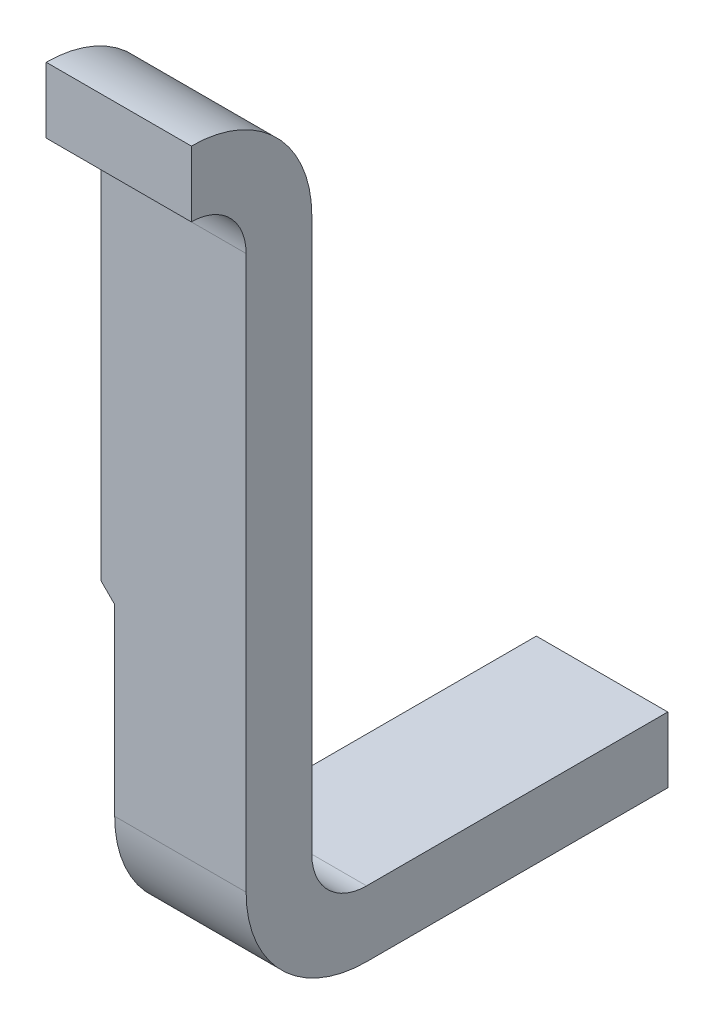
ISO-10303-21;
HEADER;
FILE_DESCRIPTION(('STEP AP214'),'2;1');
FILE_NAME('part.step','',(''),(''),'','','');
FILE_SCHEMA(('AUTOMOTIVE_DESIGN { 1 0 10303 214 1 1 1 1 }'));
ENDSEC;
DATA;
#1=APPLICATION_CONTEXT('core data for automotive mechanical design processes');
#2=APPLICATION_PROTOCOL_DEFINITION('international standard','automotive_design',2000,#1);
#3=PRODUCT_CONTEXT('',#1,'mechanical');
#4=PRODUCT('Part','Part','',(#3));
#5=PRODUCT_RELATED_PRODUCT_CATEGORY('part','',(#4));
#6=PRODUCT_DEFINITION_FORMATION('','',#4);
#7=PRODUCT_DEFINITION_CONTEXT('part definition',#1,'design');
#8=PRODUCT_DEFINITION('design','',#6,#7);
#9=PRODUCT_DEFINITION_SHAPE('','',#8);
#10=(LENGTH_UNIT() NAMED_UNIT(*) SI_UNIT(.MILLI.,.METRE.));
#11=(NAMED_UNIT(*) PLANE_ANGLE_UNIT() SI_UNIT($,.RADIAN.));
#12=(NAMED_UNIT(*) SI_UNIT($,.STERADIAN.) SOLID_ANGLE_UNIT());
#13=UNCERTAINTY_MEASURE_WITH_UNIT(LENGTH_MEASURE(1.E-05),#10,'distance_accuracy_value','');
#14=(GEOMETRIC_REPRESENTATION_CONTEXT(3) GLOBAL_UNCERTAINTY_ASSIGNED_CONTEXT((#13)) GLOBAL_UNIT_ASSIGNED_CONTEXT((#10,
#11,#12)) REPRESENTATION_CONTEXT('',''));
#15=CARTESIAN_POINT('',(0.,0.,0.));
#16=DIRECTION('',(0.,0.,1.));
#17=DIRECTION('',(1.,0.,0.));
#18=AXIS2_PLACEMENT_3D('',#15,#16,#17);
#19=CARTESIAN_POINT('',(17.46210819787,11.48941215274,-11.17169883308));
#20=DIRECTION('',(0.,0.,-1.));
#21=DIRECTION('',(-1.,0.,0.));
#22=AXIS2_PLACEMENT_3D('',#19,#20,#21);
#23=PLANE('',#22);
#24=DIRECTION('',(0.,1.,0.));
#25=VECTOR('',#24,1.);
#26=CARTESIAN_POINT('',(18.42710814532,5.079903349409,-11.17169883308));
#27=LINE('',#26,#25);
#28=CARTESIAN_POINT('',(18.42710814532,12.81951558355,-11.17169883308));
#29=VERTEX_POINT('',#28);
#30=CARTESIAN_POINT('',(18.42710814532,12.93951558355,-11.17169883308));
#31=VERTEX_POINT('',#30);
#32=EDGE_CURVE('E11',#29,#31,#27,.T.);
#33=ORIENTED_EDGE('',*,*,#32,.T.);
#34=DIRECTION('',(-1.,0.,0.));
#35=VECTOR('',#34,1.);
#36=CARTESIAN_POINT('',(13.11210817501,12.93951558355,-11.17169883308));
#37=LINE('',#36,#35);
#38=CARTESIAN_POINT('',(18.16210814532,12.93951558355,-11.17169883308));
#39=VERTEX_POINT('',#38);
#40=EDGE_CURVE('E199',#31,#39,#37,.T.);
#41=ORIENTED_EDGE('',*,*,#40,.T.);
#42=DIRECTION('',(0.,-1.,0.));
#43=VECTOR('',#42,1.);
#44=CARTESIAN_POINT('',(18.16210814532,5.079903349409,-11.17169883308));
#45=LINE('',#44,#43);
#46=CARTESIAN_POINT('',(18.16210814532,12.81951558355,-11.17169883308));
#47=VERTEX_POINT('',#46);
#48=EDGE_CURVE('E197',#39,#47,#45,.T.);
#49=ORIENTED_EDGE('',*,*,#48,.T.);
#50=DIRECTION('',(1.,0.,0.));
#51=VECTOR('',#50,1.);
#52=CARTESIAN_POINT('',(0.,12.81951558355,-11.17169883308));
#53=LINE('',#52,#51);
#54=EDGE_CURVE('E218',#47,#29,#53,.T.);
#55=ORIENTED_EDGE('',*,*,#54,.T.);
#56=EDGE_LOOP('',(#33,#41,#49,#55));
#57=FACE_BOUND('',#56,.T.);
#58=ADVANCED_FACE('F17',(#57),#23,.F.);
#59=CARTESIAN_POINT('',(18.42710814532,12.71951558355,-11.17169883308));
#60=DIRECTION('',(1.,0.,0.));
#61=DIRECTION('',(0.,0.,-1.));
#62=AXIS2_PLACEMENT_3D('',#59,#60,#61);
#63=PLANE('',#62);
#64=CARTESIAN_POINT('',(18.42710814532,12.71951558355,-11.17169883308));
#65=DIRECTION('',(-1.,0.,0.));
#66=DIRECTION('',(0.,0.,1.));
#67=AXIS2_PLACEMENT_3D('',#64,#65,#66);
#68=CIRCLE('',#67,0.22);
#69=CARTESIAN_POINT('',(18.42710814532,12.71951558355,-11.39169883308));
#70=VERTEX_POINT('',#69);
#71=EDGE_CURVE('E28',#31,#70,#68,.T.);
#72=ORIENTED_EDGE('',*,*,#71,.F.);
#73=ORIENTED_EDGE('',*,*,#32,.F.);
#74=CARTESIAN_POINT('',(18.42710814532,12.71951558355,-11.17169883308));
#75=DIRECTION('',(-1.,0.,0.));
#76=DIRECTION('',(0.,0.,-1.));
#77=AXIS2_PLACEMENT_3D('',#74,#75,#76);
#78=CIRCLE('',#77,0.1);
#79=CARTESIAN_POINT('',(18.42710814532,12.71951558355,-11.27169883308));
#80=VERTEX_POINT('',#79);
#81=EDGE_CURVE('E166',#29,#80,#78,.T.);
#82=ORIENTED_EDGE('',*,*,#81,.T.);
#83=DIRECTION('',(0.,-1.,0.));
#84=VECTOR('',#83,1.);
#85=CARTESIAN_POINT('',(18.42710814532,12.71951558355,-11.27169883308));
#86=LINE('',#85,#84);
#87=CARTESIAN_POINT('',(18.42710814532,11.70951558355,-11.27169883308));
#88=VERTEX_POINT('',#87);
#89=EDGE_CURVE('E175',#80,#88,#86,.T.);
#90=ORIENTED_EDGE('',*,*,#89,.T.);
#91=CARTESIAN_POINT('',(18.42710814532,11.70951558355,-11.49169883308));
#92=DIRECTION('',(1.,0.,0.));
#93=DIRECTION('',(0.,0.,-1.));
#94=AXIS2_PLACEMENT_3D('',#91,#92,#93);
#95=CIRCLE('',#94,0.22);
#96=CARTESIAN_POINT('',(18.42710814532,11.48951558355,-11.49169883308));
#97=VERTEX_POINT('',#96);
#98=EDGE_CURVE('E234',#88,#97,#95,.T.);
#99=ORIENTED_EDGE('',*,*,#98,.T.);
#100=DIRECTION('',(0.,0.,-1.));
#101=VECTOR('',#100,1.);
#102=CARTESIAN_POINT('',(18.42710814532,11.48951558355,-11.17169883308));
#103=LINE('',#102,#101);
#104=CARTESIAN_POINT('',(18.42710814532,11.48951558355,-12.04169883308));
#105=VERTEX_POINT('',#104);
#106=EDGE_CURVE('E155',#97,#105,#103,.T.);
#107=ORIENTED_EDGE('',*,*,#106,.T.);
#108=DIRECTION('',(0.,1.,0.));
#109=VECTOR('',#108,1.);
#110=CARTESIAN_POINT('',(18.42710814532,12.71951558355,-12.04169883308));
#111=LINE('',#110,#109);
#112=CARTESIAN_POINT('',(18.42710814532,11.60951558355,-12.04169883308));
#113=VERTEX_POINT('',#112);
#114=EDGE_CURVE('E159',#105,#113,#111,.T.);
#115=ORIENTED_EDGE('',*,*,#114,.T.);
#116=DIRECTION('',(0.,0.,1.));
#117=VECTOR('',#116,1.);
#118=CARTESIAN_POINT('',(18.42710814532,11.60951558355,-11.17169883308));
#119=LINE('',#118,#117);
#120=CARTESIAN_POINT('',(18.42710814532,11.60951558355,-11.49169883308));
#121=VERTEX_POINT('',#120);
#122=EDGE_CURVE('E124',#113,#121,#119,.T.);
#123=ORIENTED_EDGE('',*,*,#122,.T.);
#124=CARTESIAN_POINT('',(18.42710814532,11.70951558355,-11.49169883308));
#125=DIRECTION('',(-1.,0.,0.));
#126=DIRECTION('',(0.,0.,1.));
#127=AXIS2_PLACEMENT_3D('',#124,#125,#126);
#128=CIRCLE('',#127,0.1);
#129=CARTESIAN_POINT('',(18.42710814532,11.70951558355,-11.39169883308));
#130=VERTEX_POINT('',#129);
#131=EDGE_CURVE('E185',#121,#130,#128,.T.);
#132=ORIENTED_EDGE('',*,*,#131,.T.);
#133=DIRECTION('',(0.,1.,0.));
#134=VECTOR('',#133,1.);
#135=CARTESIAN_POINT('',(18.42710814532,12.71951558355,-11.39169883308));
#136=LINE('',#135,#134);
#137=EDGE_CURVE('E176',#130,#70,#136,.T.);
#138=ORIENTED_EDGE('',*,*,#137,.T.);
#139=EDGE_LOOP('',(#72,#73,#82,#90,#99,#107,#115,#123,#132,#138));
#140=FACE_BOUND('',#139,.T.);
#141=ADVANCED_FACE('F19',(#140),#63,.T.);
#142=CARTESIAN_POINT('',(12.81210814532,12.71951558355,-11.17169883308));
#143=DIRECTION('',(1.,0.,0.));
#144=DIRECTION('',(0.,0.,1.));
#145=AXIS2_PLACEMENT_3D('',#142,#143,#144);
#146=CYLINDRICAL_SURFACE('',#145,0.22);
#147=ORIENTED_EDGE('',*,*,#40,.F.);
#148=ORIENTED_EDGE('',*,*,#71,.T.);
#149=DIRECTION('',(-1.,0.,0.));
#150=VECTOR('',#149,1.);
#151=CARTESIAN_POINT('',(12.81210814532,12.71951558355,-11.39169883308));
#152=LINE('',#151,#150);
#153=CARTESIAN_POINT('',(18.16210814532,12.71951558355,-11.39169883308));
#154=VERTEX_POINT('',#153);
#155=EDGE_CURVE('E208',#70,#154,#152,.T.);
#156=ORIENTED_EDGE('',*,*,#155,.T.);
#157=CARTESIAN_POINT('',(18.16210814532,12.71951558355,-11.17169883308));
#158=DIRECTION('',(1.,0.,0.));
#159=DIRECTION('',(0.,0.,1.));
#160=AXIS2_PLACEMENT_3D('',#157,#158,#159);
#161=CIRCLE('',#160,0.22);
#162=EDGE_CURVE('E169',#154,#39,#161,.T.);
#163=ORIENTED_EDGE('',*,*,#162,.T.);
#164=EDGE_LOOP('',(#147,#148,#156,#163));
#165=FACE_BOUND('',#164,.T.);
#166=ADVANCED_FACE('F304',(#165),#146,.T.);
#167=CARTESIAN_POINT('',(18.16210814532,11.48951558355,-11.91169883308));
#168=DIRECTION('',(1.,0.,0.));
#169=DIRECTION('',(0.,0.,-1.));
#170=AXIS2_PLACEMENT_3D('',#167,#168,#169);
#171=PLANE('',#170);
#172=ORIENTED_EDGE('',*,*,#162,.F.);
#173=DIRECTION('',(0.,1.,0.));
#174=VECTOR('',#173,1.);
#175=CARTESIAN_POINT('',(18.16210814532,11.48951558355,-11.39169883308));
#176=LINE('',#175,#174);
#177=CARTESIAN_POINT('',(18.16210814532,12.06951558355,-11.39169883308));
#178=VERTEX_POINT('',#177);
#179=EDGE_CURVE('E196',#178,#154,#176,.T.);
#180=ORIENTED_EDGE('',*,*,#179,.F.);
#181=DIRECTION('',(0.,0.,-1.));
#182=VECTOR('',#181,1.);
#183=CARTESIAN_POINT('',(18.16210814532,12.06951558355,-11.91169883308));
#184=LINE('',#183,#182);
#185=CARTESIAN_POINT('',(18.16210814532,12.06951558355,-11.27169883308));
#186=VERTEX_POINT('',#185);
#187=EDGE_CURVE('E180',#186,#178,#184,.T.);
#188=ORIENTED_EDGE('',*,*,#187,.F.);
#189=DIRECTION('',(0.,-1.,0.));
#190=VECTOR('',#189,1.);
#191=CARTESIAN_POINT('',(18.16210814532,11.48951558355,-11.27169883308));
#192=LINE('',#191,#190);
#193=CARTESIAN_POINT('',(18.16210814532,12.71951558355,-11.27169883308));
#194=VERTEX_POINT('',#193);
#195=EDGE_CURVE('E172',#194,#186,#192,.T.);
#196=ORIENTED_EDGE('',*,*,#195,.F.);
#197=CARTESIAN_POINT('',(18.16210814532,12.71951558355,-11.17169883308));
#198=DIRECTION('',(-1.,0.,0.));
#199=DIRECTION('',(0.,0.,-1.));
#200=AXIS2_PLACEMENT_3D('',#197,#198,#199);
#201=CIRCLE('',#200,0.1);
#202=EDGE_CURVE('E170',#47,#194,#201,.T.);
#203=ORIENTED_EDGE('',*,*,#202,.F.);
#204=ORIENTED_EDGE('',*,*,#48,.F.);
#205=EDGE_LOOP('',(#172,#180,#188,#196,#203,#204));
#206=FACE_BOUND('',#205,.T.);
#207=ADVANCED_FACE('F301',(#206),#171,.F.);
#208=CARTESIAN_POINT('',(19.01210814532,12.71951558355,-11.17169883308));
#209=DIRECTION('',(-1.,0.,0.));
#210=DIRECTION('',(0.,0.,-1.));
#211=AXIS2_PLACEMENT_3D('',#208,#209,#210);
#212=CYLINDRICAL_SURFACE('',#211,0.1);
#213=ORIENTED_EDGE('',*,*,#54,.F.);
#214=ORIENTED_EDGE('',*,*,#202,.T.);
#215=DIRECTION('',(-1.,0.,0.));
#216=VECTOR('',#215,1.);
#217=CARTESIAN_POINT('',(19.01210814532,12.71951558355,-11.27169883308));
#218=LINE('',#217,#216);
#219=EDGE_CURVE('E221',#80,#194,#218,.T.);
#220=ORIENTED_EDGE('',*,*,#219,.F.);
#221=ORIENTED_EDGE('',*,*,#81,.F.);
#222=EDGE_LOOP('',(#213,#214,#220,#221));
#223=FACE_BOUND('',#222,.T.);
#224=ADVANCED_FACE('F366',(#223),#212,.F.);
#225=CARTESIAN_POINT('',(18.11210814532,11.48951558355,-11.27169883308));
#226=DIRECTION('',(0.,0.,1.));
#227=DIRECTION('',(1.,0.,0.));
#228=AXIS2_PLACEMENT_3D('',#225,#226,#227);
#229=PLANE('',#228);
#230=ORIENTED_EDGE('',*,*,#195,.T.);
#231=DIRECTION('',(0.707106781186048,-0.707106781187048,0.));
#232=VECTOR('',#231,1.);
#233=CARTESIAN_POINT('',(18.16210814532,12.06951558355,-11.27169883308));
#234=LINE('',#233,#232);
#235=CARTESIAN_POINT('',(18.18710814532,12.04451558355,-11.27169883308));
#236=VERTEX_POINT('',#235);
#237=EDGE_CURVE('E177',#186,#236,#234,.T.);
#238=ORIENTED_EDGE('',*,*,#237,.T.);
#239=DIRECTION('',(0.,-1.,0.));
#240=VECTOR('',#239,1.);
#241=CARTESIAN_POINT('',(18.18710814532,11.48951558355,-11.27169883308));
#242=LINE('',#241,#240);
#243=CARTESIAN_POINT('',(18.18710814532,11.70951558355,-11.27169883308));
#244=VERTEX_POINT('',#243);
#245=EDGE_CURVE('E164',#236,#244,#242,.T.);
#246=ORIENTED_EDGE('',*,*,#245,.T.);
#247=DIRECTION('',(1.,0.,0.));
#248=VECTOR('',#247,1.);
#249=CARTESIAN_POINT('',(18.11210814532,11.70951558355,-11.27169883308));
#250=LINE('',#249,#248);
#251=EDGE_CURVE('E153',#244,#88,#250,.T.);
#252=ORIENTED_EDGE('',*,*,#251,.T.);
#253=ORIENTED_EDGE('',*,*,#89,.F.);
#254=ORIENTED_EDGE('',*,*,#219,.T.);
#255=EDGE_LOOP('',(#230,#238,#246,#252,#253,#254));
#256=FACE_BOUND('',#255,.T.);
#257=ADVANCED_FACE('F260',(#256),#229,.T.);
#258=CARTESIAN_POINT('',(12.81210814532,12.93951558355,-11.39169883308));
#259=DIRECTION('',(0.,0.,1.));
#260=DIRECTION('',(1.,0.,0.));
#261=AXIS2_PLACEMENT_3D('',#258,#259,#260);
#262=PLANE('',#261);
#263=DIRECTION('',(0.,-1.,0.));
#264=VECTOR('',#263,1.);
#265=CARTESIAN_POINT('',(18.18710814532,12.93951558355,-11.39169883308));
#266=LINE('',#265,#264);
#267=CARTESIAN_POINT('',(18.18710814532,12.04451558355,-11.39169883308));
#268=VERTEX_POINT('',#267);
#269=CARTESIAN_POINT('',(18.18710814532,11.70951558355,-11.39169883308));
#270=VERTEX_POINT('',#269);
#271=EDGE_CURVE('E149',#268,#270,#266,.T.);
#272=ORIENTED_EDGE('',*,*,#271,.F.);
#273=DIRECTION('',(0.707106781186048,-0.707106781187048,0.));
#274=VECTOR('',#273,1.);
#275=CARTESIAN_POINT('',(18.16210814532,12.06951558355,-11.39169883308));
#276=LINE('',#275,#274);
#277=EDGE_CURVE('E181',#178,#268,#276,.T.);
#278=ORIENTED_EDGE('',*,*,#277,.F.);
#279=ORIENTED_EDGE('',*,*,#179,.T.);
#280=ORIENTED_EDGE('',*,*,#155,.F.);
#281=ORIENTED_EDGE('',*,*,#137,.F.);
#282=DIRECTION('',(1.,0.,0.));
#283=VECTOR('',#282,1.);
#284=CARTESIAN_POINT('',(12.81210814532,11.70951558355,-11.39169883308));
#285=LINE('',#284,#283);
#286=EDGE_CURVE('E137',#270,#130,#285,.T.);
#287=ORIENTED_EDGE('',*,*,#286,.F.);
#288=EDGE_LOOP('',(#272,#278,#279,#280,#281,#287));
#289=FACE_BOUND('',#288,.T.);
#290=ADVANCED_FACE('F286',(#289),#262,.F.);
#291=CARTESIAN_POINT('',(18.16210814532,12.06951558355,-11.91169883308));
#292=DIRECTION('',(0.707106781187048,0.707106781186048,0.));
#293=DIRECTION('',(0.,0.,-1.));
#294=AXIS2_PLACEMENT_3D('',#291,#292,#293);
#295=PLANE('',#294);
#296=ORIENTED_EDGE('',*,*,#277,.T.);
#297=DIRECTION('',(0.,0.,-1.));
#298=VECTOR('',#297,1.);
#299=CARTESIAN_POINT('',(18.18710814532,12.04451558355,-11.91169883308));
#300=LINE('',#299,#298);
#301=EDGE_CURVE('E189',#236,#268,#300,.T.);
#302=ORIENTED_EDGE('',*,*,#301,.F.);
#303=ORIENTED_EDGE('',*,*,#237,.F.);
#304=ORIENTED_EDGE('',*,*,#187,.T.);
#305=EDGE_LOOP('',(#296,#302,#303,#304));
#306=FACE_BOUND('',#305,.T.);
#307=ADVANCED_FACE('F266',(#306),#295,.F.);
#308=CARTESIAN_POINT('',(18.11210814532,11.70951558355,-11.49169883308));
#309=DIRECTION('',(-1.,0.,0.));
#310=DIRECTION('',(0.,0.,-1.));
#311=AXIS2_PLACEMENT_3D('',#308,#309,#310);
#312=CYLINDRICAL_SURFACE('',#311,0.22);
#313=ORIENTED_EDGE('',*,*,#98,.F.);
#314=ORIENTED_EDGE('',*,*,#251,.F.);
#315=CARTESIAN_POINT('',(18.18710814532,11.70951558355,-11.49169883308));
#316=DIRECTION('',(1.,0.,0.));
#317=DIRECTION('',(0.,0.,-1.));
#318=AXIS2_PLACEMENT_3D('',#315,#316,#317);
#319=CIRCLE('',#318,0.22);
#320=CARTESIAN_POINT('',(18.18710814532,11.48951558355,-11.49169883308));
#321=VERTEX_POINT('',#320);
#322=EDGE_CURVE('E160',#244,#321,#319,.T.);
#323=ORIENTED_EDGE('',*,*,#322,.T.);
#324=DIRECTION('',(-1.,0.,0.));
#325=VECTOR('',#324,1.);
#326=CARTESIAN_POINT('',(18.61210814532,11.48951558355,-11.49169883308));
#327=LINE('',#326,#325);
#328=EDGE_CURVE('E158',#97,#321,#327,.T.);
#329=ORIENTED_EDGE('',*,*,#328,.F.);
#330=EDGE_LOOP('',(#313,#314,#323,#329));
#331=FACE_BOUND('',#330,.T.);
#332=ADVANCED_FACE('F255',(#331),#312,.T.);
#333=CARTESIAN_POINT('',(18.61210814532,11.48951558355,-8.041698833076));
#334=DIRECTION('',(0.,-1.,0.));
#335=DIRECTION('',(0.,0.,-1.));
#336=AXIS2_PLACEMENT_3D('',#333,#334,#335);
#337=PLANE('',#336);
#338=DIRECTION('',(0.,0.,-1.));
#339=VECTOR('',#338,1.);
#340=CARTESIAN_POINT('',(18.18710814532,11.48951558355,-8.041698833076));
#341=LINE('',#340,#339);
#342=CARTESIAN_POINT('',(18.18710814532,11.48951558355,-12.04169883308));
#343=VERTEX_POINT('',#342);
#344=EDGE_CURVE('E165',#321,#343,#341,.T.);
#345=ORIENTED_EDGE('',*,*,#344,.T.);
#346=DIRECTION('',(1.,0.,0.));
#347=VECTOR('',#346,1.);
#348=CARTESIAN_POINT('',(12.02567879084,11.48951558355,-12.04169883308));
#349=LINE('',#348,#347);
#350=EDGE_CURVE('E21',#343,#105,#349,.T.);
#351=ORIENTED_EDGE('',*,*,#350,.T.);
#352=ORIENTED_EDGE('',*,*,#106,.F.);
#353=ORIENTED_EDGE('',*,*,#328,.T.);
#354=EDGE_LOOP('',(#345,#351,#352,#353));
#355=FACE_BOUND('',#354,.T.);
#356=ADVANCED_FACE('F248',(#355),#337,.T.);
#357=CARTESIAN_POINT('',(12.02567879084,1.609515583551,-12.04169883308));
#358=DIRECTION('',(0.,0.,1.));
#359=DIRECTION('',(1.,0.,0.));
#360=AXIS2_PLACEMENT_3D('',#357,#358,#359);
#361=PLANE('',#360);
#362=ORIENTED_EDGE('',*,*,#350,.F.);
#363=DIRECTION('',(0.,-1.,0.));
#364=VECTOR('',#363,1.);
#365=CARTESIAN_POINT('',(18.18710814532,1.609515583551,-12.04169883308));
#366=LINE('',#365,#364);
#367=CARTESIAN_POINT('',(18.18710814532,11.60951558355,-12.04169883308));
#368=VERTEX_POINT('',#367);
#369=EDGE_CURVE('E130',#368,#343,#366,.T.);
#370=ORIENTED_EDGE('',*,*,#369,.F.);
#371=DIRECTION('',(1.,0.,0.));
#372=VECTOR('',#371,1.);
#373=CARTESIAN_POINT('',(12.81210814532,11.60951558355,-12.04169883308));
#374=LINE('',#373,#372);
#375=EDGE_CURVE('E116',#368,#113,#374,.T.);
#376=ORIENTED_EDGE('',*,*,#375,.T.);
#377=ORIENTED_EDGE('',*,*,#114,.F.);
#378=EDGE_LOOP('',(#362,#370,#376,#377));
#379=FACE_BOUND('',#378,.T.);
#380=ADVANCED_FACE('F131',(#379),#361,.F.);
#381=CARTESIAN_POINT('',(12.81210814532,11.60951558355,-11.91169883308));
#382=DIRECTION('',(0.,-1.,0.));
#383=DIRECTION('',(0.,0.,-1.));
#384=AXIS2_PLACEMENT_3D('',#381,#382,#383);
#385=PLANE('',#384);
#386=DIRECTION('',(0.,0.,-1.));
#387=VECTOR('',#386,1.);
#388=CARTESIAN_POINT('',(18.18710814532,11.60951558355,-11.91169883308));
#389=LINE('',#388,#387);
#390=CARTESIAN_POINT('',(18.18710814532,11.60951558355,-11.49169883308));
#391=VERTEX_POINT('',#390);
#392=EDGE_CURVE('E121',#391,#368,#389,.T.);
#393=ORIENTED_EDGE('',*,*,#392,.F.);
#394=DIRECTION('',(1.,0.,0.));
#395=VECTOR('',#394,1.);
#396=CARTESIAN_POINT('',(12.81210814532,11.60951558355,-11.49169883308));
#397=LINE('',#396,#395);
#398=EDGE_CURVE('E190',#391,#121,#397,.T.);
#399=ORIENTED_EDGE('',*,*,#398,.T.);
#400=ORIENTED_EDGE('',*,*,#122,.F.);
#401=ORIENTED_EDGE('',*,*,#375,.F.);
#402=EDGE_LOOP('',(#393,#399,#400,#401));
#403=FACE_BOUND('',#402,.T.);
#404=ADVANCED_FACE('F118',(#403),#385,.F.);
#405=CARTESIAN_POINT('',(12.81210814532,11.70951558355,-11.49169883308));
#406=DIRECTION('',(1.,0.,0.));
#407=DIRECTION('',(0.,0.,1.));
#408=AXIS2_PLACEMENT_3D('',#405,#406,#407);
#409=CYLINDRICAL_SURFACE('',#408,0.1);
#410=ORIENTED_EDGE('',*,*,#286,.T.);
#411=ORIENTED_EDGE('',*,*,#131,.F.);
#412=ORIENTED_EDGE('',*,*,#398,.F.);
#413=CARTESIAN_POINT('',(18.18710814532,11.70951558355,-11.49169883308));
#414=DIRECTION('',(1.,0.,0.));
#415=DIRECTION('',(0.,0.,1.));
#416=AXIS2_PLACEMENT_3D('',#413,#414,#415);
#417=CIRCLE('',#416,0.1);
#418=EDGE_CURVE('E142',#270,#391,#417,.T.);
#419=ORIENTED_EDGE('',*,*,#418,.F.);
#420=EDGE_LOOP('',(#410,#411,#412,#419));
#421=FACE_BOUND('',#420,.T.);
#422=ADVANCED_FACE('F284',(#421),#409,.F.);
#423=CARTESIAN_POINT('',(18.18710814532,12.03951558355,-11.27169883308));
#424=DIRECTION('',(1.,0.,0.));
#425=DIRECTION('',(0.,0.,-1.));
#426=AXIS2_PLACEMENT_3D('',#423,#424,#425);
#427=PLANE('',#426);
#428=ORIENTED_EDGE('',*,*,#344,.F.);
#429=ORIENTED_EDGE('',*,*,#322,.F.);
#430=ORIENTED_EDGE('',*,*,#245,.F.);
#431=ORIENTED_EDGE('',*,*,#301,.T.);
#432=ORIENTED_EDGE('',*,*,#271,.T.);
#433=ORIENTED_EDGE('',*,*,#418,.T.);
#434=ORIENTED_EDGE('',*,*,#392,.T.);
#435=ORIENTED_EDGE('',*,*,#369,.T.);
#436=EDGE_LOOP('',(#428,#429,#430,#431,#432,#433,#434,#435));
#437=FACE_BOUND('',#436,.T.);
#438=ADVANCED_FACE('F139',(#437),#427,.F.);
#439=CLOSED_SHELL('',(#58,#141,#166,#207,#224,#257,#290,#307,#332,#356,#380,#404,#422,#438));
#440=MANIFOLD_SOLID_BREP('B1',#439);
#441=ADVANCED_BREP_SHAPE_REPRESENTATION('',(#18,#440),#14);
#442=SHAPE_DEFINITION_REPRESENTATION(#9,#441);
ENDSEC;
END-ISO-10303-21;
